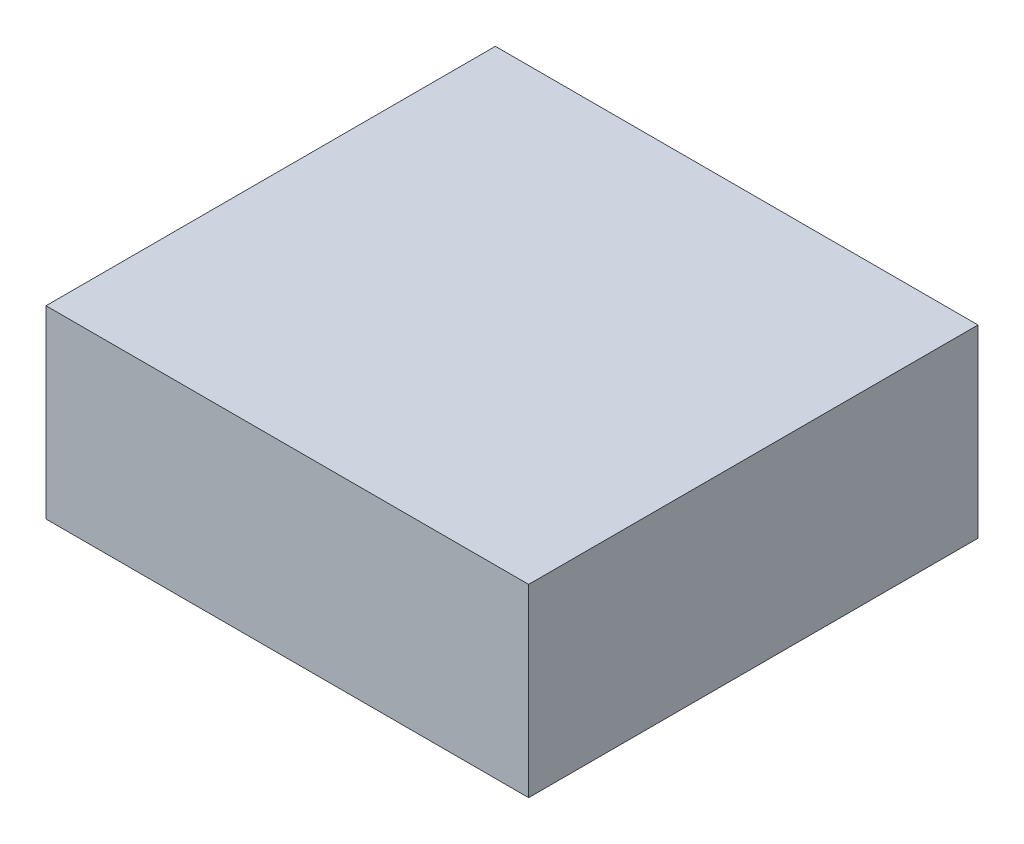
ISO-10303-21;
HEADER;
FILE_DESCRIPTION(('STEP AP214'),'2;1');
FILE_NAME('part.step','',(''),(''),'','','');
FILE_SCHEMA(('AUTOMOTIVE_DESIGN { 1 0 10303 214 1 1 1 1 }'));
ENDSEC;
DATA;
#1=APPLICATION_CONTEXT('core data for automotive mechanical design processes');
#2=APPLICATION_PROTOCOL_DEFINITION('international standard','automotive_design',2000,#1);
#3=PRODUCT_CONTEXT('',#1,'mechanical');
#4=PRODUCT('Part','Part','',(#3));
#5=PRODUCT_RELATED_PRODUCT_CATEGORY('part','',(#4));
#6=PRODUCT_DEFINITION_FORMATION('','',#4);
#7=PRODUCT_DEFINITION_CONTEXT('part definition',#1,'design');
#8=PRODUCT_DEFINITION('design','',#6,#7);
#9=PRODUCT_DEFINITION_SHAPE('','',#8);
#10=(LENGTH_UNIT() NAMED_UNIT(*) SI_UNIT(.MILLI.,.METRE.));
#11=(NAMED_UNIT(*) PLANE_ANGLE_UNIT() SI_UNIT($,.RADIAN.));
#12=(NAMED_UNIT(*) SI_UNIT($,.STERADIAN.) SOLID_ANGLE_UNIT());
#13=UNCERTAINTY_MEASURE_WITH_UNIT(LENGTH_MEASURE(1.E-05),#10,'distance_accuracy_value','');
#14=(GEOMETRIC_REPRESENTATION_CONTEXT(3) GLOBAL_UNCERTAINTY_ASSIGNED_CONTEXT((#13)) GLOBAL_UNIT_ASSIGNED_CONTEXT((#10,
#11,#12)) REPRESENTATION_CONTEXT('',''));
#15=CARTESIAN_POINT('',(0.,0.,0.));
#16=DIRECTION('',(0.,0.,1.));
#17=DIRECTION('',(1.,0.,0.));
#18=AXIS2_PLACEMENT_3D('',#15,#16,#17);
#19=CARTESIAN_POINT('',(-53.7742309134848,28.194,-13.7987215170218));
#20=DIRECTION('',(1.,0.,0.));
#21=DIRECTION('',(0.,0.,-1.));
#22=AXIS2_PLACEMENT_3D('',#19,#20,#21);
#23=PLANE('',#22);
#24=DIRECTION('',(0.,0.,1.));
#25=VECTOR('',#24,1.);
#26=CARTESIAN_POINT('',(-53.7742309134848,0.,-13.7987215170218));
#27=LINE('',#26,#25);
#28=CARTESIAN_POINT('',(-53.7742309134848,0.,-13.7987215170218));
#29=VERTEX_POINT('',#28);
#30=CARTESIAN_POINT('',(-53.7742309134848,0.,54.7812784829783));
#31=VERTEX_POINT('',#30);
#32=EDGE_CURVE('E141',#29,#31,#27,.T.);
#33=ORIENTED_EDGE('',*,*,#32,.T.);
#34=DIRECTION('',(0.,-1.,0.));
#35=VECTOR('',#34,1.);
#36=CARTESIAN_POINT('',(-53.7742309134848,28.194,54.7812784829783));
#37=LINE('',#36,#35);
#38=CARTESIAN_POINT('',(-53.7742309134848,28.194,54.7812784829783));
#39=VERTEX_POINT('',#38);
#40=EDGE_CURVE('E11',#39,#31,#37,.T.);
#41=ORIENTED_EDGE('',*,*,#40,.F.);
#42=DIRECTION('',(0.,0.,1.));
#43=VECTOR('',#42,1.);
#44=CARTESIAN_POINT('',(-53.7742309134848,28.194,-13.7987215170218));
#45=LINE('',#44,#43);
#46=CARTESIAN_POINT('',(-53.7742309134848,28.194,-13.7987215170218));
#47=VERTEX_POINT('',#46);
#48=EDGE_CURVE('E145',#47,#39,#45,.T.);
#49=ORIENTED_EDGE('',*,*,#48,.F.);
#50=DIRECTION('',(0.,-1.,0.));
#51=VECTOR('',#50,1.);
#52=CARTESIAN_POINT('',(-53.7742309134848,28.194,-13.7987215170218));
#53=LINE('',#52,#51);
#54=EDGE_CURVE('E151',#47,#29,#53,.T.);
#55=ORIENTED_EDGE('',*,*,#54,.T.);
#56=EDGE_LOOP('',(#33,#41,#49,#55));
#57=FACE_BOUND('',#56,.T.);
#58=ADVANCED_FACE('F33',(#57),#23,.F.);
#59=CARTESIAN_POINT('',(-53.7742309134848,28.194,54.7812784829783));
#60=DIRECTION('',(0.,0.,-1.));
#61=DIRECTION('',(-1.,0.,0.));
#62=AXIS2_PLACEMENT_3D('',#59,#60,#61);
#63=PLANE('',#62);
#64=DIRECTION('',(1.,0.,0.));
#65=VECTOR('',#64,1.);
#66=CARTESIAN_POINT('',(-53.7742309134848,0.,54.7812784829783));
#67=LINE('',#66,#65);
#68=CARTESIAN_POINT('',(19.8857690865152,0.,54.7812784829783));
#69=VERTEX_POINT('',#68);
#70=EDGE_CURVE('E154',#31,#69,#67,.T.);
#71=ORIENTED_EDGE('',*,*,#70,.T.);
#72=DIRECTION('',(0.,-1.,0.));
#73=VECTOR('',#72,1.);
#74=CARTESIAN_POINT('',(19.8857690865152,28.194,54.7812784829783));
#75=LINE('',#74,#73);
#76=CARTESIAN_POINT('',(19.8857690865152,28.194,54.7812784829783));
#77=VERTEX_POINT('',#76);
#78=EDGE_CURVE('E40',#77,#69,#75,.T.);
#79=ORIENTED_EDGE('',*,*,#78,.F.);
#80=DIRECTION('',(1.,0.,0.));
#81=VECTOR('',#80,1.);
#82=CARTESIAN_POINT('',(-53.7742309134848,28.194,54.7812784829783));
#83=LINE('',#82,#81);
#84=EDGE_CURVE('E84',#39,#77,#83,.T.);
#85=ORIENTED_EDGE('',*,*,#84,.F.);
#86=ORIENTED_EDGE('',*,*,#40,.T.);
#87=EDGE_LOOP('',(#71,#79,#85,#86));
#88=FACE_BOUND('',#87,.T.);
#89=ADVANCED_FACE('F182',(#88),#63,.F.);
#90=CARTESIAN_POINT('',(19.8857690865152,28.194,-13.7987215170218));
#91=DIRECTION('',(-1.,0.,0.));
#92=DIRECTION('',(0.,0.,1.));
#93=AXIS2_PLACEMENT_3D('',#90,#91,#92);
#94=PLANE('',#93);
#95=DIRECTION('',(0.,0.,-1.));
#96=VECTOR('',#95,1.);
#97=CARTESIAN_POINT('',(19.8857690865152,0.,-13.7987215170218));
#98=LINE('',#97,#96);
#99=CARTESIAN_POINT('',(19.8857690865152,0.,-13.7987215170218));
#100=VERTEX_POINT('',#99);
#101=EDGE_CURVE('E156',#69,#100,#98,.T.);
#102=ORIENTED_EDGE('',*,*,#101,.T.);
#103=DIRECTION('',(0.,-1.,0.));
#104=VECTOR('',#103,1.);
#105=CARTESIAN_POINT('',(19.8857690865152,28.194,-13.7987215170218));
#106=LINE('',#105,#104);
#107=CARTESIAN_POINT('',(19.8857690865152,28.194,-13.7987215170218));
#108=VERTEX_POINT('',#107);
#109=EDGE_CURVE('E160',#108,#100,#106,.T.);
#110=ORIENTED_EDGE('',*,*,#109,.F.);
#111=DIRECTION('',(0.,0.,-1.));
#112=VECTOR('',#111,1.);
#113=CARTESIAN_POINT('',(19.8857690865152,28.194,-13.7987215170218));
#114=LINE('',#113,#112);
#115=EDGE_CURVE('E148',#77,#108,#114,.T.);
#116=ORIENTED_EDGE('',*,*,#115,.F.);
#117=ORIENTED_EDGE('',*,*,#78,.T.);
#118=EDGE_LOOP('',(#102,#110,#116,#117));
#119=FACE_BOUND('',#118,.T.);
#120=ADVANCED_FACE('F165',(#119),#94,.F.);
#121=CARTESIAN_POINT('',(-53.7742309134848,28.194,-13.7987215170218));
#122=DIRECTION('',(0.,0.,1.));
#123=DIRECTION('',(1.,0.,0.));
#124=AXIS2_PLACEMENT_3D('',#121,#122,#123);
#125=PLANE('',#124);
#126=DIRECTION('',(-1.,0.,0.));
#127=VECTOR('',#126,1.);
#128=CARTESIAN_POINT('',(-53.7742309134848,0.,-13.7987215170218));
#129=LINE('',#128,#127);
#130=EDGE_CURVE('E77',#100,#29,#129,.T.);
#131=ORIENTED_EDGE('',*,*,#130,.T.);
#132=ORIENTED_EDGE('',*,*,#54,.F.);
#133=DIRECTION('',(-1.,0.,0.));
#134=VECTOR('',#133,1.);
#135=CARTESIAN_POINT('',(-53.7742309134848,28.194,-13.7987215170218));
#136=LINE('',#135,#134);
#137=EDGE_CURVE('E56',#108,#47,#136,.T.);
#138=ORIENTED_EDGE('',*,*,#137,.F.);
#139=ORIENTED_EDGE('',*,*,#109,.T.);
#140=EDGE_LOOP('',(#131,#132,#138,#139));
#141=FACE_BOUND('',#140,.T.);
#142=ADVANCED_FACE('F173',(#141),#125,.F.);
#143=CARTESIAN_POINT('',(-53.7742309134848,28.194,54.7812784829783));
#144=DIRECTION('',(0.,1.,0.));
#145=DIRECTION('',(0.,0.,1.));
#146=AXIS2_PLACEMENT_3D('',#143,#144,#145);
#147=PLANE('',#146);
#148=ORIENTED_EDGE('',*,*,#48,.T.);
#149=ORIENTED_EDGE('',*,*,#84,.T.);
#150=ORIENTED_EDGE('',*,*,#115,.T.);
#151=ORIENTED_EDGE('',*,*,#137,.T.);
#152=EDGE_LOOP('',(#148,#149,#150,#151));
#153=FACE_BOUND('',#152,.T.);
#154=ADVANCED_FACE('F175',(#153),#147,.T.);
#155=CARTESIAN_POINT('',(-53.7742309134848,0.,54.7812784829783));
#156=DIRECTION('',(0.,1.,0.));
#157=DIRECTION('',(0.,0.,1.));
#158=AXIS2_PLACEMENT_3D('',#155,#156,#157);
#159=PLANE('',#158);
#160=DIRECTION('',(1.,0.,0.));
#161=VECTOR('',#160,1.);
#162=CARTESIAN_POINT('',(-47.4242309134848,0.,-7.44872151702175));
#163=LINE('',#162,#161);
#164=CARTESIAN_POINT('',(-47.4242309134848,0.,-7.44872151702175));
#165=VERTEX_POINT('',#164);
#166=CARTESIAN_POINT('',(13.5357690865152,0.,-7.44872151702175));
#167=VERTEX_POINT('',#166);
#168=EDGE_CURVE('E135',#165,#167,#163,.T.);
#169=ORIENTED_EDGE('',*,*,#168,.F.);
#170=DIRECTION('',(0.,0.,-1.));
#171=VECTOR('',#170,1.);
#172=CARTESIAN_POINT('',(-47.4242309134848,0.,48.4312784829783));
#173=LINE('',#172,#171);
#174=CARTESIAN_POINT('',(-47.4242309134848,0.,48.4312784829783));
#175=VERTEX_POINT('',#174);
#176=EDGE_CURVE('E47',#175,#165,#173,.T.);
#177=ORIENTED_EDGE('',*,*,#176,.F.);
#178=DIRECTION('',(-1.,0.,0.));
#179=VECTOR('',#178,1.);
#180=CARTESIAN_POINT('',(-47.4242309134848,0.,48.4312784829783));
#181=LINE('',#180,#179);
#182=CARTESIAN_POINT('',(13.5357690865152,0.,48.4312784829783));
#183=VERTEX_POINT('',#182);
#184=EDGE_CURVE('E126',#183,#175,#181,.T.);
#185=ORIENTED_EDGE('',*,*,#184,.F.);
#186=DIRECTION('',(0.,0.,1.));
#187=VECTOR('',#186,1.);
#188=CARTESIAN_POINT('',(13.5357690865152,0.,48.4312784829783));
#189=LINE('',#188,#187);
#190=EDGE_CURVE('E129',#167,#183,#189,.T.);
#191=ORIENTED_EDGE('',*,*,#190,.F.);
#192=EDGE_LOOP('',(#169,#177,#185,#191));
#193=FACE_BOUND('',#192,.T.);
#194=ORIENTED_EDGE('',*,*,#32,.F.);
#195=ORIENTED_EDGE('',*,*,#130,.F.);
#196=ORIENTED_EDGE('',*,*,#101,.F.);
#197=ORIENTED_EDGE('',*,*,#70,.F.);
#198=EDGE_LOOP('',(#194,#195,#196,#197));
#199=FACE_BOUND('',#198,.T.);
#200=ADVANCED_FACE('F169',(#193,#199),#159,.F.);
#201=CARTESIAN_POINT('',(-47.4242309134848,21.844,48.4312784829783));
#202=DIRECTION('',(-1.,0.,0.));
#203=DIRECTION('',(0.,0.,1.));
#204=AXIS2_PLACEMENT_3D('',#201,#202,#203);
#205=PLANE('',#204);
#206=ORIENTED_EDGE('',*,*,#176,.T.);
#207=DIRECTION('',(0.,-1.,0.));
#208=VECTOR('',#207,1.);
#209=CARTESIAN_POINT('',(-47.4242309134848,21.844,-7.44872151702175));
#210=LINE('',#209,#208);
#211=CARTESIAN_POINT('',(-47.4242309134848,21.844,-7.44872151702175));
#212=VERTEX_POINT('',#211);
#213=EDGE_CURVE('E104',#212,#165,#210,.T.);
#214=ORIENTED_EDGE('',*,*,#213,.F.);
#215=DIRECTION('',(0.,0.,-1.));
#216=VECTOR('',#215,1.);
#217=CARTESIAN_POINT('',(-47.4242309134848,21.844,48.4312784829783));
#218=LINE('',#217,#216);
#219=CARTESIAN_POINT('',(-47.4242309134848,21.844,48.4312784829783));
#220=VERTEX_POINT('',#219);
#221=EDGE_CURVE('E108',#220,#212,#218,.T.);
#222=ORIENTED_EDGE('',*,*,#221,.F.);
#223=DIRECTION('',(0.,-1.,0.));
#224=VECTOR('',#223,1.);
#225=CARTESIAN_POINT('',(-47.4242309134848,21.844,48.4312784829783));
#226=LINE('',#225,#224);
#227=EDGE_CURVE('E139',#220,#175,#226,.T.);
#228=ORIENTED_EDGE('',*,*,#227,.T.);
#229=EDGE_LOOP('',(#206,#214,#222,#228));
#230=FACE_BOUND('',#229,.T.);
#231=ADVANCED_FACE('F106',(#230),#205,.F.);
#232=CARTESIAN_POINT('',(-47.4242309134848,21.844,48.4312784829783));
#233=DIRECTION('',(0.,0.,1.));
#234=DIRECTION('',(1.,0.,0.));
#235=AXIS2_PLACEMENT_3D('',#232,#233,#234);
#236=PLANE('',#235);
#237=ORIENTED_EDGE('',*,*,#184,.T.);
#238=ORIENTED_EDGE('',*,*,#227,.F.);
#239=DIRECTION('',(-1.,0.,0.));
#240=VECTOR('',#239,1.);
#241=CARTESIAN_POINT('',(-47.4242309134848,21.844,48.4312784829783));
#242=LINE('',#241,#240);
#243=CARTESIAN_POINT('',(13.5357690865152,21.844,48.4312784829783));
#244=VERTEX_POINT('',#243);
#245=EDGE_CURVE('E114',#244,#220,#242,.T.);
#246=ORIENTED_EDGE('',*,*,#245,.F.);
#247=DIRECTION('',(0.,-1.,0.));
#248=VECTOR('',#247,1.);
#249=CARTESIAN_POINT('',(13.5357690865152,21.844,48.4312784829783));
#250=LINE('',#249,#248);
#251=EDGE_CURVE('E142',#244,#183,#250,.T.);
#252=ORIENTED_EDGE('',*,*,#251,.T.);
#253=EDGE_LOOP('',(#237,#238,#246,#252));
#254=FACE_BOUND('',#253,.T.);
#255=ADVANCED_FACE('F222',(#254),#236,.F.);
#256=CARTESIAN_POINT('',(13.5357690865152,21.844,48.4312784829783));
#257=DIRECTION('',(1.,0.,0.));
#258=DIRECTION('',(0.,0.,-1.));
#259=AXIS2_PLACEMENT_3D('',#256,#257,#258);
#260=PLANE('',#259);
#261=ORIENTED_EDGE('',*,*,#190,.T.);
#262=ORIENTED_EDGE('',*,*,#251,.F.);
#263=DIRECTION('',(0.,0.,1.));
#264=VECTOR('',#263,1.);
#265=CARTESIAN_POINT('',(13.5357690865152,21.844,48.4312784829783));
#266=LINE('',#265,#264);
#267=CARTESIAN_POINT('',(13.5357690865152,21.844,-7.44872151702175));
#268=VERTEX_POINT('',#267);
#269=EDGE_CURVE('E122',#268,#244,#266,.T.);
#270=ORIENTED_EDGE('',*,*,#269,.F.);
#271=DIRECTION('',(0.,-1.,0.));
#272=VECTOR('',#271,1.);
#273=CARTESIAN_POINT('',(13.5357690865152,21.844,-7.44872151702175));
#274=LINE('',#273,#272);
#275=EDGE_CURVE('E113',#268,#167,#274,.T.);
#276=ORIENTED_EDGE('',*,*,#275,.T.);
#277=EDGE_LOOP('',(#261,#262,#270,#276));
#278=FACE_BOUND('',#277,.T.);
#279=ADVANCED_FACE('F231',(#278),#260,.F.);
#280=CARTESIAN_POINT('',(-47.4242309134848,21.844,-7.44872151702175));
#281=DIRECTION('',(0.,0.,-1.));
#282=DIRECTION('',(-1.,0.,0.));
#283=AXIS2_PLACEMENT_3D('',#280,#281,#282);
#284=PLANE('',#283);
#285=ORIENTED_EDGE('',*,*,#168,.T.);
#286=ORIENTED_EDGE('',*,*,#275,.F.);
#287=DIRECTION('',(1.,0.,0.));
#288=VECTOR('',#287,1.);
#289=CARTESIAN_POINT('',(-47.4242309134848,21.844,-7.44872151702175));
#290=LINE('',#289,#288);
#291=EDGE_CURVE('E117',#212,#268,#290,.T.);
#292=ORIENTED_EDGE('',*,*,#291,.F.);
#293=ORIENTED_EDGE('',*,*,#213,.T.);
#294=EDGE_LOOP('',(#285,#286,#292,#293));
#295=FACE_BOUND('',#294,.T.);
#296=ADVANCED_FACE('F118',(#295),#284,.F.);
#297=CARTESIAN_POINT('',(-47.4242309134848,21.844,-7.44872151702175));
#298=DIRECTION('',(0.,-1.,0.));
#299=DIRECTION('',(0.,0.,-1.));
#300=AXIS2_PLACEMENT_3D('',#297,#298,#299);
#301=PLANE('',#300);
#302=ORIENTED_EDGE('',*,*,#221,.T.);
#303=ORIENTED_EDGE('',*,*,#291,.T.);
#304=ORIENTED_EDGE('',*,*,#269,.T.);
#305=ORIENTED_EDGE('',*,*,#245,.T.);
#306=EDGE_LOOP('',(#302,#303,#304,#305));
#307=FACE_BOUND('',#306,.T.);
#308=ADVANCED_FACE('F124',(#307),#301,.T.);
#309=CLOSED_SHELL('',(#58,#89,#120,#142,#154,#200,#231,#255,#279,#296,#308));
#310=MANIFOLD_SOLID_BREP('B2',#309);
#311=ADVANCED_BREP_SHAPE_REPRESENTATION('',(#18,#310),#14);
#312=SHAPE_DEFINITION_REPRESENTATION(#9,#311);
ENDSEC;
END-ISO-10303-21;
